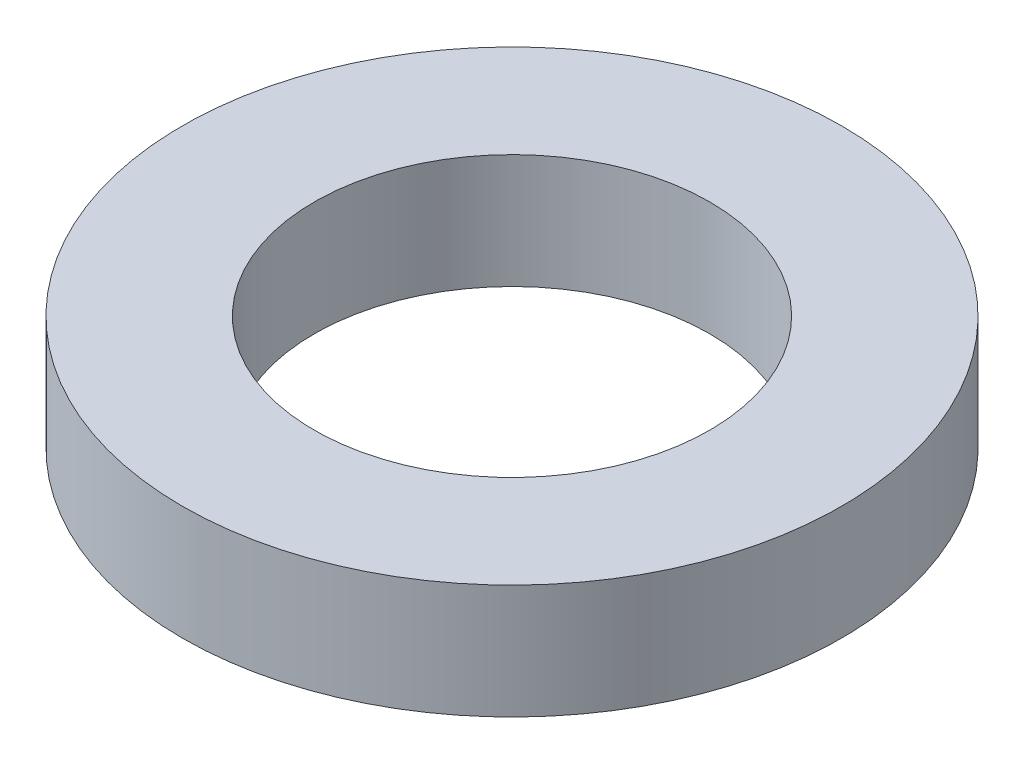
ISO-10303-21;
HEADER;
FILE_DESCRIPTION(('STEP AP214'),'2;1');
FILE_NAME('part.step','',(''),(''),'','','');
FILE_SCHEMA(('AUTOMOTIVE_DESIGN { 1 0 10303 214 1 1 1 1 }'));
ENDSEC;
DATA;
#1=APPLICATION_CONTEXT('core data for automotive mechanical design processes');
#2=APPLICATION_PROTOCOL_DEFINITION('international standard','automotive_design',2000,#1);
#3=PRODUCT_CONTEXT('',#1,'mechanical');
#4=PRODUCT('Part','Part','',(#3));
#5=PRODUCT_RELATED_PRODUCT_CATEGORY('part','',(#4));
#6=PRODUCT_DEFINITION_FORMATION('','',#4);
#7=PRODUCT_DEFINITION_CONTEXT('part definition',#1,'design');
#8=PRODUCT_DEFINITION('design','',#6,#7);
#9=PRODUCT_DEFINITION_SHAPE('','',#8);
#10=(LENGTH_UNIT() NAMED_UNIT(*) SI_UNIT(.MILLI.,.METRE.));
#11=(NAMED_UNIT(*) PLANE_ANGLE_UNIT() SI_UNIT($,.RADIAN.));
#12=(NAMED_UNIT(*) SI_UNIT($,.STERADIAN.) SOLID_ANGLE_UNIT());
#13=UNCERTAINTY_MEASURE_WITH_UNIT(LENGTH_MEASURE(1.E-05),#10,'distance_accuracy_value','');
#14=(GEOMETRIC_REPRESENTATION_CONTEXT(3) GLOBAL_UNCERTAINTY_ASSIGNED_CONTEXT((#13)) GLOBAL_UNIT_ASSIGNED_CONTEXT((#10,
#11,#12)) REPRESENTATION_CONTEXT('',''));
#15=CARTESIAN_POINT('',(0.,0.,0.));
#16=DIRECTION('',(0.,0.,1.));
#17=DIRECTION('',(1.,0.,0.));
#18=AXIS2_PLACEMENT_3D('',#15,#16,#17);
#19=CARTESIAN_POINT('',(0.,26.,0.));
#20=DIRECTION('',(0.,-1.,0.));
#21=DIRECTION('',(0.,0.,-1.));
#22=AXIS2_PLACEMENT_3D('',#19,#20,#21);
#23=CYLINDRICAL_SURFACE('',#22,75.);
#24=CARTESIAN_POINT('',(0.,26.,0.));
#25=DIRECTION('',(0.,1.,0.));
#26=DIRECTION('',(0.,0.,1.));
#27=AXIS2_PLACEMENT_3D('',#24,#25,#26);
#28=CIRCLE('',#27,75.);
#29=CARTESIAN_POINT('',(0.,26.,-75.));
#30=VERTEX_POINT('',#29);
#31=EDGE_CURVE('E10',#30,#30,#28,.T.);
#32=CARTESIAN_POINT('',(0.,0.,0.));
#33=DIRECTION('',(0.,1.,0.));
#34=DIRECTION('',(0.,0.,1.));
#35=AXIS2_PLACEMENT_3D('',#32,#33,#34);
#36=CIRCLE('',#35,75.);
#37=CARTESIAN_POINT('',(0.,0.,-75.));
#38=VERTEX_POINT('',#37);
#39=EDGE_CURVE('E37',#38,#38,#36,.T.);
#40=CARTESIAN_POINT('',(0.,26.,-75.));
#41=CARTESIAN_POINT('',(0.,25.7291666666667,-75.));
#42=CARTESIAN_POINT('',(0.,25.4583333333333,-75.));
#43=CARTESIAN_POINT('',(0.,24.9166666666667,-75.));
#44=CARTESIAN_POINT('',(0.,24.6458333333333,-75.));
#45=CARTESIAN_POINT('',(0.,24.1041666666667,-75.));
#46=CARTESIAN_POINT('',(0.,23.8333333333333,-75.));
#47=CARTESIAN_POINT('',(0.,23.2916666666667,-75.));
#48=CARTESIAN_POINT('',(0.,23.0208333333333,-75.));
#49=CARTESIAN_POINT('',(0.,22.4791666666667,-75.));
#50=CARTESIAN_POINT('',(0.,22.2083333333333,-75.));
#51=CARTESIAN_POINT('',(0.,21.6666666666667,-75.));
#52=CARTESIAN_POINT('',(0.,21.3958333333333,-75.));
#53=CARTESIAN_POINT('',(0.,20.8541666666667,-75.));
#54=CARTESIAN_POINT('',(0.,20.5833333333333,-75.));
#55=CARTESIAN_POINT('',(0.,20.0416666666667,-75.));
#56=CARTESIAN_POINT('',(0.,19.7708333333333,-75.));
#57=CARTESIAN_POINT('',(0.,19.2291666666667,-75.));
#58=CARTESIAN_POINT('',(0.,18.9583333333333,-75.));
#59=CARTESIAN_POINT('',(0.,18.4166666666667,-75.));
#60=CARTESIAN_POINT('',(0.,18.1458333333333,-75.));
#61=CARTESIAN_POINT('',(0.,17.6041666666667,-75.));
#62=CARTESIAN_POINT('',(0.,17.3333333333333,-75.));
#63=CARTESIAN_POINT('',(0.,16.7916666666667,-75.));
#64=CARTESIAN_POINT('',(0.,16.5208333333333,-75.));
#65=CARTESIAN_POINT('',(0.,15.9791666666667,-75.));
#66=CARTESIAN_POINT('',(0.,15.7083333333333,-75.));
#67=CARTESIAN_POINT('',(0.,15.1666666666667,-75.));
#68=CARTESIAN_POINT('',(0.,14.8958333333333,-75.));
#69=CARTESIAN_POINT('',(0.,14.3541666666667,-75.));
#70=CARTESIAN_POINT('',(0.,14.0833333333333,-75.));
#71=CARTESIAN_POINT('',(0.,13.5416666666667,-75.));
#72=CARTESIAN_POINT('',(0.,13.2708333333333,-75.));
#73=CARTESIAN_POINT('',(0.,12.7291666666667,-75.));
#74=CARTESIAN_POINT('',(0.,12.4583333333333,-75.));
#75=CARTESIAN_POINT('',(0.,11.9166666666667,-75.));
#76=CARTESIAN_POINT('',(0.,11.6458333333333,-75.));
#77=CARTESIAN_POINT('',(0.,11.1041666666667,-75.));
#78=CARTESIAN_POINT('',(0.,10.8333333333333,-75.));
#79=CARTESIAN_POINT('',(0.,10.2916666666667,-75.));
#80=CARTESIAN_POINT('',(0.,10.0208333333333,-75.));
#81=CARTESIAN_POINT('',(0.,9.47916666666667,-75.));
#82=CARTESIAN_POINT('',(0.,9.20833333333333,-75.));
#83=CARTESIAN_POINT('',(0.,8.66666666666667,-75.));
#84=CARTESIAN_POINT('',(0.,8.39583333333333,-75.));
#85=CARTESIAN_POINT('',(0.,7.85416666666667,-75.));
#86=CARTESIAN_POINT('',(0.,7.58333333333333,-75.));
#87=CARTESIAN_POINT('',(0.,7.04166666666667,-75.));
#88=CARTESIAN_POINT('',(0.,6.77083333333333,-75.));
#89=CARTESIAN_POINT('',(0.,6.22916666666667,-75.));
#90=CARTESIAN_POINT('',(0.,5.95833333333333,-75.));
#91=CARTESIAN_POINT('',(0.,5.41666666666667,-75.));
#92=CARTESIAN_POINT('',(0.,5.14583333333333,-75.));
#93=CARTESIAN_POINT('',(0.,4.60416666666667,-75.));
#94=CARTESIAN_POINT('',(0.,4.33333333333333,-75.));
#95=CARTESIAN_POINT('',(0.,3.79166666666667,-75.));
#96=CARTESIAN_POINT('',(0.,3.52083333333333,-75.));
#97=CARTESIAN_POINT('',(0.,2.97916666666667,-75.));
#98=CARTESIAN_POINT('',(0.,2.70833333333333,-75.));
#99=CARTESIAN_POINT('',(0.,2.16666666666667,-75.));
#100=CARTESIAN_POINT('',(0.,1.89583333333333,-75.));
#101=CARTESIAN_POINT('',(0.,1.35416666666667,-75.));
#102=CARTESIAN_POINT('',(0.,1.08333333333333,-75.));
#103=CARTESIAN_POINT('',(0.,0.541666666666667,-75.));
#104=CARTESIAN_POINT('',(0.,0.270833333333334,-75.));
#105=CARTESIAN_POINT('',(0.,0.,-75.));
#106=B_SPLINE_CURVE_WITH_KNOTS('',3,(#40,#41,#42,#43,#44,#45,#46,#47,#48,#49,#50,#51,#52,#53,
#54,#55,#56,#57,#58,#59,#60,#61,#62,#63,#64,#65,#66,#67,#68,#69,#70,#71,#72,#73,#74,#75,#76,#77,
#78,#79,#80,#81,#82,#83,#84,#85,#86,#87,#88,#89,#90,#91,#92,#93,#94,#95,#96,#97,#98,#99,#100,
#101,#102,#103,#104,#105),.UNSPECIFIED.,.F.,.F.,(4,2,2,2,2,2,2,2,2,2,2,2,2,2,2,2,2,2,2,2,2,2,2,
2,2,2,2,2,2,2,2,2,4),(0.,0.812500000000001,1.625,2.4375,3.25,4.0625,4.875,5.6875,6.5,7.3125,
8.125,8.9375,9.75,10.5625,11.375,12.1875,13.,13.8125,14.625,15.4375,16.25,17.0625,17.875,
18.6875,19.5,20.3125,21.125,21.9375,22.75,23.5625,24.375,25.1875,26.),.UNSPECIFIED.);
#107=EDGE_CURVE('BSEAM40',#30,#38,#106,.T.);
#108=ORIENTED_EDGE('',*,*,#31,.F.);
#109=ORIENTED_EDGE('',*,*,#39,.T.);
#110=ORIENTED_EDGE('',*,*,#107,.T.);
#111=ORIENTED_EDGE('',*,*,#107,.F.);
#112=EDGE_LOOP('',(#108,#110,#109,#111));
#113=FACE_BOUND('',#112,.T.);
#114=ADVANCED_FACE('F40',(#113),#23,.T.);
#115=CARTESIAN_POINT('',(0.,26.,0.));
#116=DIRECTION('',(0.,1.,0.));
#117=DIRECTION('',(0.,0.,1.));
#118=AXIS2_PLACEMENT_3D('',#115,#116,#117);
#119=PLANE('',#118);
#120=CARTESIAN_POINT('',(0.,26.,0.));
#121=DIRECTION('',(0.,1.,0.));
#122=DIRECTION('',(0.,0.,1.));
#123=AXIS2_PLACEMENT_3D('',#120,#121,#122);
#124=CIRCLE('',#123,45.);
#125=CARTESIAN_POINT('',(0.,26.,-45.));
#126=VERTEX_POINT('',#125);
#127=EDGE_CURVE('E50',#126,#126,#124,.T.);
#128=ORIENTED_EDGE('',*,*,#127,.F.);
#129=EDGE_LOOP('',(#128));
#130=FACE_BOUND('',#129,.T.);
#131=ORIENTED_EDGE('',*,*,#31,.T.);
#132=EDGE_LOOP('',(#131));
#133=FACE_BOUND('',#132,.T.);
#134=ADVANCED_FACE('F59',(#130,#133),#119,.T.);
#135=CARTESIAN_POINT('',(0.,0.,0.));
#136=DIRECTION('',(0.,1.,0.));
#137=DIRECTION('',(0.,0.,1.));
#138=AXIS2_PLACEMENT_3D('',#135,#136,#137);
#139=PLANE('',#138);
#140=CARTESIAN_POINT('',(0.,0.,0.));
#141=DIRECTION('',(0.,1.,0.));
#142=DIRECTION('',(0.,0.,1.));
#143=AXIS2_PLACEMENT_3D('',#140,#141,#142);
#144=CIRCLE('',#143,45.);
#145=CARTESIAN_POINT('',(0.,0.,-45.));
#146=VERTEX_POINT('',#145);
#147=EDGE_CURVE('E47',#146,#146,#144,.T.);
#148=ORIENTED_EDGE('',*,*,#147,.T.);
#149=EDGE_LOOP('',(#148));
#150=FACE_BOUND('',#149,.T.);
#151=ORIENTED_EDGE('',*,*,#39,.F.);
#152=EDGE_LOOP('',(#151));
#153=FACE_BOUND('',#152,.T.);
#154=ADVANCED_FACE('F58',(#150,#153),#139,.F.);
#155=CARTESIAN_POINT('',(0.,26.,0.));
#156=DIRECTION('',(0.,-1.,0.));
#157=DIRECTION('',(0.,0.,-1.));
#158=AXIS2_PLACEMENT_3D('',#155,#156,#157);
#159=CYLINDRICAL_SURFACE('',#158,45.);
#160=CARTESIAN_POINT('',(0.,26.,-45.));
#161=CARTESIAN_POINT('',(0.,25.7291666666667,-45.));
#162=CARTESIAN_POINT('',(0.,25.4583333333333,-45.));
#163=CARTESIAN_POINT('',(0.,24.9166666666667,-45.));
#164=CARTESIAN_POINT('',(0.,24.6458333333333,-45.));
#165=CARTESIAN_POINT('',(0.,24.1041666666667,-45.));
#166=CARTESIAN_POINT('',(0.,23.8333333333333,-45.));
#167=CARTESIAN_POINT('',(0.,23.2916666666667,-45.));
#168=CARTESIAN_POINT('',(0.,23.0208333333333,-45.));
#169=CARTESIAN_POINT('',(0.,22.4791666666667,-45.));
#170=CARTESIAN_POINT('',(0.,22.2083333333333,-45.));
#171=CARTESIAN_POINT('',(0.,21.6666666666667,-45.));
#172=CARTESIAN_POINT('',(0.,21.3958333333333,-45.));
#173=CARTESIAN_POINT('',(0.,20.8541666666667,-45.));
#174=CARTESIAN_POINT('',(0.,20.5833333333333,-45.));
#175=CARTESIAN_POINT('',(0.,20.0416666666667,-45.));
#176=CARTESIAN_POINT('',(0.,19.7708333333333,-45.));
#177=CARTESIAN_POINT('',(0.,19.2291666666667,-45.));
#178=CARTESIAN_POINT('',(0.,18.9583333333333,-45.));
#179=CARTESIAN_POINT('',(0.,18.4166666666667,-45.));
#180=CARTESIAN_POINT('',(0.,18.1458333333333,-45.));
#181=CARTESIAN_POINT('',(0.,17.6041666666667,-45.));
#182=CARTESIAN_POINT('',(0.,17.3333333333333,-45.));
#183=CARTESIAN_POINT('',(0.,16.7916666666667,-45.));
#184=CARTESIAN_POINT('',(0.,16.5208333333333,-45.));
#185=CARTESIAN_POINT('',(0.,15.9791666666667,-45.));
#186=CARTESIAN_POINT('',(0.,15.7083333333333,-45.));
#187=CARTESIAN_POINT('',(0.,15.1666666666667,-45.));
#188=CARTESIAN_POINT('',(0.,14.8958333333333,-45.));
#189=CARTESIAN_POINT('',(0.,14.3541666666667,-45.));
#190=CARTESIAN_POINT('',(0.,14.0833333333333,-45.));
#191=CARTESIAN_POINT('',(0.,13.5416666666667,-45.));
#192=CARTESIAN_POINT('',(0.,13.2708333333333,-45.));
#193=CARTESIAN_POINT('',(0.,12.7291666666667,-45.));
#194=CARTESIAN_POINT('',(0.,12.4583333333333,-45.));
#195=CARTESIAN_POINT('',(0.,11.9166666666667,-45.));
#196=CARTESIAN_POINT('',(0.,11.6458333333333,-45.));
#197=CARTESIAN_POINT('',(0.,11.1041666666667,-45.));
#198=CARTESIAN_POINT('',(0.,10.8333333333333,-45.));
#199=CARTESIAN_POINT('',(0.,10.2916666666667,-45.));
#200=CARTESIAN_POINT('',(0.,10.0208333333333,-45.));
#201=CARTESIAN_POINT('',(0.,9.47916666666667,-45.));
#202=CARTESIAN_POINT('',(0.,9.20833333333333,-45.));
#203=CARTESIAN_POINT('',(0.,8.66666666666667,-45.));
#204=CARTESIAN_POINT('',(0.,8.39583333333333,-45.));
#205=CARTESIAN_POINT('',(0.,7.85416666666667,-45.));
#206=CARTESIAN_POINT('',(0.,7.58333333333333,-45.));
#207=CARTESIAN_POINT('',(0.,7.04166666666667,-45.));
#208=CARTESIAN_POINT('',(0.,6.77083333333333,-45.));
#209=CARTESIAN_POINT('',(0.,6.22916666666667,-45.));
#210=CARTESIAN_POINT('',(0.,5.95833333333333,-45.));
#211=CARTESIAN_POINT('',(0.,5.41666666666667,-45.));
#212=CARTESIAN_POINT('',(0.,5.14583333333333,-45.));
#213=CARTESIAN_POINT('',(0.,4.60416666666667,-45.));
#214=CARTESIAN_POINT('',(0.,4.33333333333333,-45.));
#215=CARTESIAN_POINT('',(0.,3.79166666666667,-45.));
#216=CARTESIAN_POINT('',(0.,3.52083333333333,-45.));
#217=CARTESIAN_POINT('',(0.,2.97916666666667,-45.));
#218=CARTESIAN_POINT('',(0.,2.70833333333333,-45.));
#219=CARTESIAN_POINT('',(0.,2.16666666666667,-45.));
#220=CARTESIAN_POINT('',(0.,1.89583333333333,-45.));
#221=CARTESIAN_POINT('',(0.,1.35416666666667,-45.));
#222=CARTESIAN_POINT('',(0.,1.08333333333333,-45.));
#223=CARTESIAN_POINT('',(0.,0.541666666666667,-45.));
#224=CARTESIAN_POINT('',(0.,0.270833333333334,-45.));
#225=CARTESIAN_POINT('',(0.,0.,-45.));
#226=B_SPLINE_CURVE_WITH_KNOTS('',3,(#160,#161,#162,#163,#164,#165,#166,#167,#168,#169,#170,
#171,#172,#173,#174,#175,#176,#177,#178,#179,#180,#181,#182,#183,#184,#185,#186,#187,#188,#189,
#190,#191,#192,#193,#194,#195,#196,#197,#198,#199,#200,#201,#202,#203,#204,#205,#206,#207,#208,
#209,#210,#211,#212,#213,#214,#215,#216,#217,#218,#219,#220,#221,#222,#223,#224,#225),
.UNSPECIFIED.,.F.,.F.,(4,2,2,2,2,2,2,2,2,2,2,2,2,2,2,2,2,2,2,2,2,2,2,2,2,2,2,2,2,2,2,2,4),(0.,
0.812499999999997,1.625,2.4375,3.25,4.0625,4.875,5.6875,6.5,7.3125,8.125,8.93749999999999,
9.74999999999999,10.5625,11.375,12.1875,13.,13.8125,14.625,15.4375,16.25,17.0625,17.875,18.6875,
19.5,20.3125,21.125,21.9375,22.75,23.5625,24.375,25.1875,26.),.UNSPECIFIED.);
#227=EDGE_CURVE('BSEAM54',#126,#146,#226,.T.);
#228=ORIENTED_EDGE('',*,*,#127,.T.);
#229=ORIENTED_EDGE('',*,*,#147,.F.);
#230=ORIENTED_EDGE('',*,*,#227,.T.);
#231=ORIENTED_EDGE('',*,*,#227,.F.);
#232=EDGE_LOOP('',(#228,#230,#229,#231));
#233=FACE_BOUND('',#232,.T.);
#234=ADVANCED_FACE('F54',(#233),#159,.F.);
#235=CLOSED_SHELL('',(#114,#134,#154,#234));
#236=MANIFOLD_SOLID_BREP('B2',#235);
#237=ADVANCED_BREP_SHAPE_REPRESENTATION('',(#18,#236),#14);
#238=SHAPE_DEFINITION_REPRESENTATION(#9,#237);
ENDSEC;
END-ISO-10303-21;
